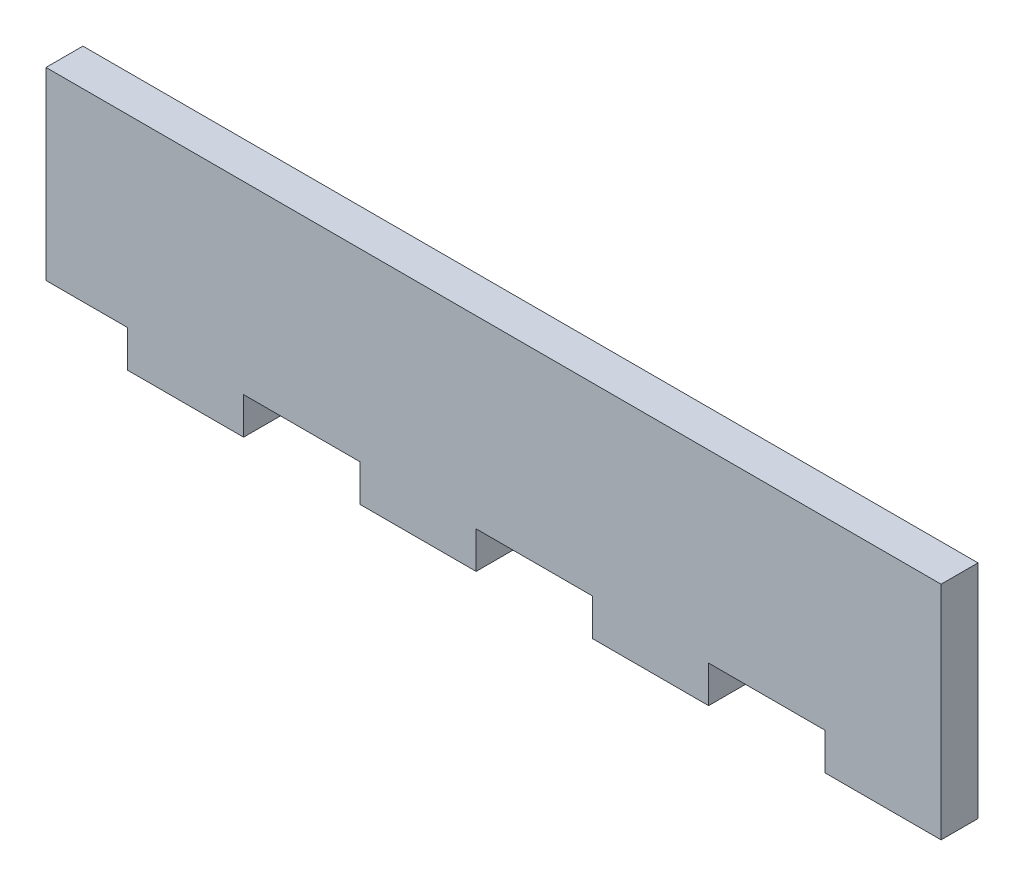
ISO-10303-21;
HEADER;
FILE_DESCRIPTION(('STEP AP214'),'2;1');
FILE_NAME('part.step','',(''),(''),'','','');
FILE_SCHEMA(('AUTOMOTIVE_DESIGN { 1 0 10303 214 1 1 1 1 }'));
ENDSEC;
DATA;
#1=APPLICATION_CONTEXT('core data for automotive mechanical design processes');
#2=APPLICATION_PROTOCOL_DEFINITION('international standard','automotive_design',2000,#1);
#3=PRODUCT_CONTEXT('',#1,'mechanical');
#4=PRODUCT('Part','Part','',(#3));
#5=PRODUCT_RELATED_PRODUCT_CATEGORY('part','',(#4));
#6=PRODUCT_DEFINITION_FORMATION('','',#4);
#7=PRODUCT_DEFINITION_CONTEXT('part definition',#1,'design');
#8=PRODUCT_DEFINITION('design','',#6,#7);
#9=PRODUCT_DEFINITION_SHAPE('','',#8);
#10=(LENGTH_UNIT() NAMED_UNIT(*) SI_UNIT(.MILLI.,.METRE.));
#11=(NAMED_UNIT(*) PLANE_ANGLE_UNIT() SI_UNIT($,.RADIAN.));
#12=(NAMED_UNIT(*) SI_UNIT($,.STERADIAN.) SOLID_ANGLE_UNIT());
#13=UNCERTAINTY_MEASURE_WITH_UNIT(LENGTH_MEASURE(1.E-05),#10,'distance_accuracy_value','');
#14=(GEOMETRIC_REPRESENTATION_CONTEXT(3) GLOBAL_UNCERTAINTY_ASSIGNED_CONTEXT((#13)) GLOBAL_UNIT_ASSIGNED_CONTEXT((#10,
#11,#12)) REPRESENTATION_CONTEXT('',''));
#15=CARTESIAN_POINT('',(0.,0.,0.));
#16=DIRECTION('',(0.,0.,1.));
#17=DIRECTION('',(1.,0.,0.));
#18=AXIS2_PLACEMENT_3D('',#15,#16,#17);
#19=CARTESIAN_POINT('',(77.,0.,2.15194444444444));
#20=DIRECTION('',(0.,1.,0.));
#21=DIRECTION('',(0.,0.,1.));
#22=AXIS2_PLACEMENT_3D('',#19,#20,#21);
#23=PLANE('',#22);
#24=DIRECTION('',(-1.,0.,0.));
#25=VECTOR('',#24,1.);
#26=CARTESIAN_POINT('',(77.,0.,-1.02305555555556));
#27=LINE('',#26,#25);
#28=CARTESIAN_POINT('',(7.00000000000001,0.,-1.02305555555556));
#29=VERTEX_POINT('',#28);
#30=CARTESIAN_POINT('',(0.,0.,-1.02305555555556));
#31=VERTEX_POINT('',#30);
#32=EDGE_CURVE('E208',#29,#31,#27,.T.);
#33=ORIENTED_EDGE('',*,*,#32,.F.);
#34=DIRECTION('',(0.,0.,-1.));
#35=VECTOR('',#34,1.);
#36=CARTESIAN_POINT('',(7.00000000000001,0.,2.15194444444444));
#37=LINE('',#36,#35);
#38=CARTESIAN_POINT('',(7.00000000000001,0.,2.15194444444444));
#39=VERTEX_POINT('',#38);
#40=EDGE_CURVE('E335',#39,#29,#37,.T.);
#41=ORIENTED_EDGE('',*,*,#40,.F.);
#42=DIRECTION('',(-1.,0.,0.));
#43=VECTOR('',#42,1.);
#44=CARTESIAN_POINT('',(77.,0.,2.15194444444444));
#45=LINE('',#44,#43);
#46=CARTESIAN_POINT('',(0.,0.,2.15194444444444));
#47=VERTEX_POINT('',#46);
#48=EDGE_CURVE('E49',#39,#47,#45,.T.);
#49=ORIENTED_EDGE('',*,*,#48,.T.);
#50=DIRECTION('',(0.,0.,-1.));
#51=VECTOR('',#50,1.);
#52=CARTESIAN_POINT('',(0.,0.,2.15194444444444));
#53=LINE('',#52,#51);
#54=EDGE_CURVE('E238',#47,#31,#53,.T.);
#55=ORIENTED_EDGE('',*,*,#54,.T.);
#56=EDGE_LOOP('',(#33,#41,#49,#55));
#57=FACE_BOUND('',#56,.T.);
#58=ADVANCED_FACE('F39',(#57),#23,.F.);
#59=CARTESIAN_POINT('',(27.,0.,2.15194444444444));
#60=VERTEX_POINT('',#59);
#61=CARTESIAN_POINT('',(17.,0.,2.15194444444444));
#62=VERTEX_POINT('',#61);
#63=EDGE_CURVE('E186',#60,#62,#45,.T.);
#64=ORIENTED_EDGE('',*,*,#63,.T.);
#65=DIRECTION('',(0.,0.,-1.));
#66=VECTOR('',#65,1.);
#67=CARTESIAN_POINT('',(17.,0.,2.15194444444444));
#68=LINE('',#67,#66);
#69=CARTESIAN_POINT('',(17.,0.,-1.02305555555556));
#70=VERTEX_POINT('',#69);
#71=EDGE_CURVE('E168',#62,#70,#68,.T.);
#72=ORIENTED_EDGE('',*,*,#71,.T.);
#73=CARTESIAN_POINT('',(27.,0.,-1.02305555555556));
#74=VERTEX_POINT('',#73);
#75=EDGE_CURVE('E213',#74,#70,#27,.T.);
#76=ORIENTED_EDGE('',*,*,#75,.F.);
#77=DIRECTION('',(0.,0.,-1.));
#78=VECTOR('',#77,1.);
#79=CARTESIAN_POINT('',(27.,0.,2.15194444444444));
#80=LINE('',#79,#78);
#81=EDGE_CURVE('E194',#60,#74,#80,.T.);
#82=ORIENTED_EDGE('',*,*,#81,.F.);
#83=EDGE_LOOP('',(#64,#72,#76,#82));
#84=FACE_BOUND('',#83,.T.);
#85=ADVANCED_FACE('F193',(#84),#23,.F.);
#86=CARTESIAN_POINT('',(47.,0.,2.15194444444444));
#87=VERTEX_POINT('',#86);
#88=CARTESIAN_POINT('',(37.,0.,2.15194444444444));
#89=VERTEX_POINT('',#88);
#90=EDGE_CURVE('E48',#87,#89,#45,.T.);
#91=ORIENTED_EDGE('',*,*,#90,.T.);
#92=DIRECTION('',(0.,0.,-1.));
#93=VECTOR('',#92,1.);
#94=CARTESIAN_POINT('',(37.,0.,2.15194444444444));
#95=LINE('',#94,#93);
#96=CARTESIAN_POINT('',(37.,0.,-1.02305555555556));
#97=VERTEX_POINT('',#96);
#98=EDGE_CURVE('E312',#89,#97,#95,.T.);
#99=ORIENTED_EDGE('',*,*,#98,.T.);
#100=CARTESIAN_POINT('',(47.,0.,-1.02305555555556));
#101=VERTEX_POINT('',#100);
#102=EDGE_CURVE('E207',#101,#97,#27,.T.);
#103=ORIENTED_EDGE('',*,*,#102,.F.);
#104=DIRECTION('',(0.,0.,-1.));
#105=VECTOR('',#104,1.);
#106=CARTESIAN_POINT('',(47.,0.,2.15194444444444));
#107=LINE('',#106,#105);
#108=EDGE_CURVE('E271',#87,#101,#107,.T.);
#109=ORIENTED_EDGE('',*,*,#108,.F.);
#110=EDGE_LOOP('',(#91,#99,#103,#109));
#111=FACE_BOUND('',#110,.T.);
#112=ADVANCED_FACE('F403',(#111),#23,.F.);
#113=CARTESIAN_POINT('',(67.,0.,2.15194444444444));
#114=VERTEX_POINT('',#113);
#115=CARTESIAN_POINT('',(57.,0.,2.15194444444444));
#116=VERTEX_POINT('',#115);
#117=EDGE_CURVE('E11',#114,#116,#45,.T.);
#118=ORIENTED_EDGE('',*,*,#117,.T.);
#119=DIRECTION('',(0.,0.,-1.));
#120=VECTOR('',#119,1.);
#121=CARTESIAN_POINT('',(57.,0.,2.15194444444444));
#122=LINE('',#121,#120);
#123=CARTESIAN_POINT('',(57.,0.,-1.02305555555556));
#124=VERTEX_POINT('',#123);
#125=EDGE_CURVE('E278',#116,#124,#122,.T.);
#126=ORIENTED_EDGE('',*,*,#125,.T.);
#127=CARTESIAN_POINT('',(67.,0.,-1.02305555555556));
#128=VERTEX_POINT('',#127);
#129=EDGE_CURVE('E199',#128,#124,#27,.T.);
#130=ORIENTED_EDGE('',*,*,#129,.F.);
#131=DIRECTION('',(0.,0.,-1.));
#132=VECTOR('',#131,1.);
#133=CARTESIAN_POINT('',(67.,0.,2.15194444444444));
#134=LINE('',#133,#132);
#135=EDGE_CURVE('E244',#114,#128,#134,.T.);
#136=ORIENTED_EDGE('',*,*,#135,.F.);
#137=EDGE_LOOP('',(#118,#126,#130,#136));
#138=FACE_BOUND('',#137,.T.);
#139=ADVANCED_FACE('F388',(#138),#23,.F.);
#140=CARTESIAN_POINT('',(77.,0.,2.15194444444444));
#141=DIRECTION('',(0.,0.,-1.));
#142=DIRECTION('',(-1.,0.,0.));
#143=AXIS2_PLACEMENT_3D('',#140,#141,#142);
#144=PLANE('',#143);
#145=DIRECTION('',(0.,-1.,0.));
#146=VECTOR('',#145,1.);
#147=CARTESIAN_POINT('',(0.,0.,2.15194444444444));
#148=LINE('',#147,#146);
#149=CARTESIAN_POINT('',(0.,15.875,2.15194444444444));
#150=VERTEX_POINT('',#149);
#151=EDGE_CURVE('E241',#150,#47,#148,.T.);
#152=ORIENTED_EDGE('',*,*,#151,.T.);
#153=ORIENTED_EDGE('',*,*,#48,.F.);
#154=DIRECTION('',(0.,1.,0.));
#155=VECTOR('',#154,1.);
#156=CARTESIAN_POINT('',(7.00000000000001,0.,2.15194444444444));
#157=LINE('',#156,#155);
#158=CARTESIAN_POINT('',(7.00000000000001,-3.175,2.15194444444444));
#159=VERTEX_POINT('',#158);
#160=EDGE_CURVE('E179',#159,#39,#157,.T.);
#161=ORIENTED_EDGE('',*,*,#160,.F.);
#162=DIRECTION('',(-1.,0.,0.));
#163=VECTOR('',#162,1.);
#164=CARTESIAN_POINT('',(17.,-3.175,2.15194444444444));
#165=LINE('',#164,#163);
#166=CARTESIAN_POINT('',(17.,-3.175,2.15194444444444));
#167=VERTEX_POINT('',#166);
#168=EDGE_CURVE('E189',#167,#159,#165,.T.);
#169=ORIENTED_EDGE('',*,*,#168,.F.);
#170=DIRECTION('',(0.,-1.,0.));
#171=VECTOR('',#170,1.);
#172=CARTESIAN_POINT('',(17.,0.,2.15194444444444));
#173=LINE('',#172,#171);
#174=EDGE_CURVE('E171',#62,#167,#173,.T.);
#175=ORIENTED_EDGE('',*,*,#174,.F.);
#176=ORIENTED_EDGE('',*,*,#63,.F.);
#177=DIRECTION('',(0.,1.,0.));
#178=VECTOR('',#177,1.);
#179=CARTESIAN_POINT('',(27.,0.,2.15194444444444));
#180=LINE('',#179,#178);
#181=CARTESIAN_POINT('',(27.,-3.175,2.15194444444444));
#182=VERTEX_POINT('',#181);
#183=EDGE_CURVE('E317',#182,#60,#180,.T.);
#184=ORIENTED_EDGE('',*,*,#183,.F.);
#185=DIRECTION('',(-1.,0.,0.));
#186=VECTOR('',#185,1.);
#187=CARTESIAN_POINT('',(37.,-3.175,2.15194444444444));
#188=LINE('',#187,#186);
#189=CARTESIAN_POINT('',(37.,-3.175,2.15194444444444));
#190=VERTEX_POINT('',#189);
#191=EDGE_CURVE('E338',#190,#182,#188,.T.);
#192=ORIENTED_EDGE('',*,*,#191,.F.);
#193=DIRECTION('',(0.,-1.,0.));
#194=VECTOR('',#193,1.);
#195=CARTESIAN_POINT('',(37.,0.,2.15194444444444));
#196=LINE('',#195,#194);
#197=EDGE_CURVE('E327',#89,#190,#196,.T.);
#198=ORIENTED_EDGE('',*,*,#197,.F.);
#199=ORIENTED_EDGE('',*,*,#90,.F.);
#200=DIRECTION('',(0.,1.,0.));
#201=VECTOR('',#200,1.);
#202=CARTESIAN_POINT('',(47.,0.,2.15194444444444));
#203=LINE('',#202,#201);
#204=CARTESIAN_POINT('',(47.,-3.175,2.15194444444444));
#205=VERTEX_POINT('',#204);
#206=EDGE_CURVE('E283',#205,#87,#203,.T.);
#207=ORIENTED_EDGE('',*,*,#206,.F.);
#208=DIRECTION('',(-1.,0.,0.));
#209=VECTOR('',#208,1.);
#210=CARTESIAN_POINT('',(57.,-3.175,2.15194444444444));
#211=LINE('',#210,#209);
#212=CARTESIAN_POINT('',(57.,-3.175,2.15194444444444));
#213=VERTEX_POINT('',#212);
#214=EDGE_CURVE('E305',#213,#205,#211,.T.);
#215=ORIENTED_EDGE('',*,*,#214,.F.);
#216=DIRECTION('',(0.,-1.,0.));
#217=VECTOR('',#216,1.);
#218=CARTESIAN_POINT('',(57.,0.,2.15194444444444));
#219=LINE('',#218,#217);
#220=EDGE_CURVE('E295',#116,#213,#219,.T.);
#221=ORIENTED_EDGE('',*,*,#220,.F.);
#222=ORIENTED_EDGE('',*,*,#117,.F.);
#223=DIRECTION('',(0.,1.,0.));
#224=VECTOR('',#223,1.);
#225=CARTESIAN_POINT('',(67.,0.,2.15194444444444));
#226=LINE('',#225,#224);
#227=CARTESIAN_POINT('',(67.,-3.175,2.15194444444444));
#228=VERTEX_POINT('',#227);
#229=EDGE_CURVE('E257',#228,#114,#226,.T.);
#230=ORIENTED_EDGE('',*,*,#229,.F.);
#231=DIRECTION('',(-1.,0.,0.));
#232=VECTOR('',#231,1.);
#233=CARTESIAN_POINT('',(77.,-3.175,2.15194444444444));
#234=LINE('',#233,#232);
#235=CARTESIAN_POINT('',(77.,-3.175,2.15194444444444));
#236=VERTEX_POINT('',#235);
#237=EDGE_CURVE('E266',#236,#228,#234,.T.);
#238=ORIENTED_EDGE('',*,*,#237,.F.);
#239=DIRECTION('',(0.,-1.,0.));
#240=VECTOR('',#239,1.);
#241=CARTESIAN_POINT('',(77.,0.,2.15194444444444));
#242=LINE('',#241,#240);
#243=CARTESIAN_POINT('',(77.,15.875,2.15194444444444));
#244=VERTEX_POINT('',#243);
#245=EDGE_CURVE('E234',#244,#236,#242,.T.);
#246=ORIENTED_EDGE('',*,*,#245,.F.);
#247=DIRECTION('',(-1.,0.,0.));
#248=VECTOR('',#247,1.);
#249=CARTESIAN_POINT('',(77.,15.875,2.15194444444444));
#250=LINE('',#249,#248);
#251=EDGE_CURVE('E221',#244,#150,#250,.T.);
#252=ORIENTED_EDGE('',*,*,#251,.T.);
#253=EDGE_LOOP('',(#152,#153,#161,#169,#175,#176,#184,#192,#198,#199,#207,#215,#221,#222,#230,
#238,#246,#252));
#254=FACE_BOUND('',#253,.T.);
#255=ADVANCED_FACE('F41',(#254),#144,.F.);
#256=CARTESIAN_POINT('',(77.,0.,-1.02305555555556));
#257=DIRECTION('',(0.,0.,1.));
#258=DIRECTION('',(0.,-1.,0.));
#259=AXIS2_PLACEMENT_3D('',#256,#257,#258);
#260=PLANE('',#259);
#261=DIRECTION('',(0.,1.,0.));
#262=VECTOR('',#261,1.);
#263=CARTESIAN_POINT('',(0.,0.,-1.02305555555556));
#264=LINE('',#263,#262);
#265=CARTESIAN_POINT('',(0.,15.875,-1.02305555555556));
#266=VERTEX_POINT('',#265);
#267=EDGE_CURVE('E235',#31,#266,#264,.T.);
#268=ORIENTED_EDGE('',*,*,#267,.T.);
#269=DIRECTION('',(-1.,0.,0.));
#270=VECTOR('',#269,1.);
#271=CARTESIAN_POINT('',(77.,15.875,-1.02305555555556));
#272=LINE('',#271,#270);
#273=CARTESIAN_POINT('',(77.,15.875,-1.02305555555556));
#274=VERTEX_POINT('',#273);
#275=EDGE_CURVE('E216',#274,#266,#272,.T.);
#276=ORIENTED_EDGE('',*,*,#275,.F.);
#277=DIRECTION('',(0.,1.,0.));
#278=VECTOR('',#277,1.);
#279=CARTESIAN_POINT('',(77.,0.,-1.02305555555556));
#280=LINE('',#279,#278);
#281=CARTESIAN_POINT('',(77.,-3.175,-1.02305555555556));
#282=VERTEX_POINT('',#281);
#283=EDGE_CURVE('E247',#282,#274,#280,.T.);
#284=ORIENTED_EDGE('',*,*,#283,.F.);
#285=DIRECTION('',(-1.,0.,0.));
#286=VECTOR('',#285,1.);
#287=CARTESIAN_POINT('',(77.,-3.175,-1.02305555555556));
#288=LINE('',#287,#286);
#289=CARTESIAN_POINT('',(67.,-3.175,-1.02305555555556));
#290=VERTEX_POINT('',#289);
#291=EDGE_CURVE('E267',#282,#290,#288,.T.);
#292=ORIENTED_EDGE('',*,*,#291,.T.);
#293=DIRECTION('',(0.,1.,0.));
#294=VECTOR('',#293,1.);
#295=CARTESIAN_POINT('',(67.,0.,-1.02305555555556));
#296=LINE('',#295,#294);
#297=EDGE_CURVE('E263',#290,#128,#296,.T.);
#298=ORIENTED_EDGE('',*,*,#297,.T.);
#299=ORIENTED_EDGE('',*,*,#129,.T.);
#300=DIRECTION('',(0.,-1.,0.));
#301=VECTOR('',#300,1.);
#302=CARTESIAN_POINT('',(57.,0.,-1.02305555555556));
#303=LINE('',#302,#301);
#304=CARTESIAN_POINT('',(57.,-3.175,-1.02305555555556));
#305=VERTEX_POINT('',#304);
#306=EDGE_CURVE('E300',#124,#305,#303,.T.);
#307=ORIENTED_EDGE('',*,*,#306,.T.);
#308=DIRECTION('',(-1.,0.,0.));
#309=VECTOR('',#308,1.);
#310=CARTESIAN_POINT('',(57.,-3.175,-1.02305555555556));
#311=LINE('',#310,#309);
#312=CARTESIAN_POINT('',(47.,-3.175,-1.02305555555556));
#313=VERTEX_POINT('',#312);
#314=EDGE_CURVE('E296',#305,#313,#311,.T.);
#315=ORIENTED_EDGE('',*,*,#314,.T.);
#316=DIRECTION('',(0.,1.,0.));
#317=VECTOR('',#316,1.);
#318=CARTESIAN_POINT('',(47.,0.,-1.02305555555556));
#319=LINE('',#318,#317);
#320=EDGE_CURVE('E292',#313,#101,#319,.T.);
#321=ORIENTED_EDGE('',*,*,#320,.T.);
#322=ORIENTED_EDGE('',*,*,#102,.T.);
#323=DIRECTION('',(0.,-1.,0.));
#324=VECTOR('',#323,1.);
#325=CARTESIAN_POINT('',(37.,0.,-1.02305555555556));
#326=LINE('',#325,#324);
#327=CARTESIAN_POINT('',(37.,-3.175,-1.02305555555556));
#328=VERTEX_POINT('',#327);
#329=EDGE_CURVE('E331',#97,#328,#326,.T.);
#330=ORIENTED_EDGE('',*,*,#329,.T.);
#331=DIRECTION('',(-1.,0.,0.));
#332=VECTOR('',#331,1.);
#333=CARTESIAN_POINT('',(37.,-3.175,-1.02305555555556));
#334=LINE('',#333,#332);
#335=CARTESIAN_POINT('',(27.,-3.175,-1.02305555555556));
#336=VERTEX_POINT('',#335);
#337=EDGE_CURVE('E328',#328,#336,#334,.T.);
#338=ORIENTED_EDGE('',*,*,#337,.T.);
#339=DIRECTION('',(0.,1.,0.));
#340=VECTOR('',#339,1.);
#341=CARTESIAN_POINT('',(27.,0.,-1.02305555555556));
#342=LINE('',#341,#340);
#343=EDGE_CURVE('E63',#336,#74,#342,.T.);
#344=ORIENTED_EDGE('',*,*,#343,.T.);
#345=ORIENTED_EDGE('',*,*,#75,.T.);
#346=DIRECTION('',(0.,-1.,0.));
#347=VECTOR('',#346,1.);
#348=CARTESIAN_POINT('',(17.,0.,-1.02305555555556));
#349=LINE('',#348,#347);
#350=CARTESIAN_POINT('',(17.,-3.175,-1.02305555555556));
#351=VERTEX_POINT('',#350);
#352=EDGE_CURVE('E173',#70,#351,#349,.T.);
#353=ORIENTED_EDGE('',*,*,#352,.T.);
#354=DIRECTION('',(-1.,0.,0.));
#355=VECTOR('',#354,1.);
#356=CARTESIAN_POINT('',(17.,-3.175,-1.02305555555556));
#357=LINE('',#356,#355);
#358=CARTESIAN_POINT('',(7.00000000000001,-3.175,-1.02305555555556));
#359=VERTEX_POINT('',#358);
#360=EDGE_CURVE('E354',#351,#359,#357,.T.);
#361=ORIENTED_EDGE('',*,*,#360,.T.);
#362=DIRECTION('',(0.,1.,0.));
#363=VECTOR('',#362,1.);
#364=CARTESIAN_POINT('',(7.00000000000001,0.,-1.02305555555556));
#365=LINE('',#364,#363);
#366=EDGE_CURVE('E56',#359,#29,#365,.T.);
#367=ORIENTED_EDGE('',*,*,#366,.T.);
#368=ORIENTED_EDGE('',*,*,#32,.T.);
#369=EDGE_LOOP('',(#268,#276,#284,#292,#298,#299,#307,#315,#321,#322,#330,#338,#344,#345,#353,
#361,#367,#368));
#370=FACE_BOUND('',#369,.T.);
#371=ADVANCED_FACE('F371',(#370),#260,.F.);
#372=CARTESIAN_POINT('',(77.,15.875,2.15194444444444));
#373=DIRECTION('',(0.,-1.,0.));
#374=DIRECTION('',(0.,0.,-1.));
#375=AXIS2_PLACEMENT_3D('',#372,#373,#374);
#376=PLANE('',#375);
#377=DIRECTION('',(0.,0.,1.));
#378=VECTOR('',#377,1.);
#379=CARTESIAN_POINT('',(0.,15.875,2.15194444444444));
#380=LINE('',#379,#378);
#381=EDGE_CURVE('E231',#266,#150,#380,.T.);
#382=ORIENTED_EDGE('',*,*,#381,.T.);
#383=ORIENTED_EDGE('',*,*,#251,.F.);
#384=DIRECTION('',(0.,0.,1.));
#385=VECTOR('',#384,1.);
#386=CARTESIAN_POINT('',(77.,15.875,2.15194444444444));
#387=LINE('',#386,#385);
#388=EDGE_CURVE('E228',#274,#244,#387,.T.);
#389=ORIENTED_EDGE('',*,*,#388,.F.);
#390=ORIENTED_EDGE('',*,*,#275,.T.);
#391=EDGE_LOOP('',(#382,#383,#389,#390));
#392=FACE_BOUND('',#391,.T.);
#393=ADVANCED_FACE('F373',(#392),#376,.F.);
#394=CARTESIAN_POINT('',(77.,0.,0.));
#395=DIRECTION('',(-1.,0.,0.));
#396=DIRECTION('',(0.,0.,1.));
#397=AXIS2_PLACEMENT_3D('',#394,#395,#396);
#398=PLANE('',#397);
#399=ORIENTED_EDGE('',*,*,#245,.T.);
#400=DIRECTION('',(0.,0.,-1.));
#401=VECTOR('',#400,1.);
#402=CARTESIAN_POINT('',(77.,-3.175,2.15194444444444));
#403=LINE('',#402,#401);
#404=EDGE_CURVE('E252',#236,#282,#403,.T.);
#405=ORIENTED_EDGE('',*,*,#404,.T.);
#406=ORIENTED_EDGE('',*,*,#283,.T.);
#407=ORIENTED_EDGE('',*,*,#388,.T.);
#408=EDGE_LOOP('',(#399,#405,#406,#407));
#409=FACE_BOUND('',#408,.T.);
#410=ADVANCED_FACE('F376',(#409),#398,.F.);
#411=CARTESIAN_POINT('',(0.,0.,0.));
#412=DIRECTION('',(-1.,0.,0.));
#413=DIRECTION('',(0.,0.,1.));
#414=AXIS2_PLACEMENT_3D('',#411,#412,#413);
#415=PLANE('',#414);
#416=ORIENTED_EDGE('',*,*,#151,.F.);
#417=ORIENTED_EDGE('',*,*,#381,.F.);
#418=ORIENTED_EDGE('',*,*,#267,.F.);
#419=ORIENTED_EDGE('',*,*,#54,.F.);
#420=EDGE_LOOP('',(#416,#417,#418,#419));
#421=FACE_BOUND('',#420,.T.);
#422=ADVANCED_FACE('F370',(#421),#415,.T.);
#423=CARTESIAN_POINT('',(67.,0.,2.15194444444444));
#424=DIRECTION('',(-1.,0.,0.));
#425=DIRECTION('',(0.,0.,1.));
#426=AXIS2_PLACEMENT_3D('',#423,#424,#425);
#427=PLANE('',#426);
#428=ORIENTED_EDGE('',*,*,#297,.F.);
#429=DIRECTION('',(0.,0.,-1.));
#430=VECTOR('',#429,1.);
#431=CARTESIAN_POINT('',(67.,-3.175,2.15194444444444));
#432=LINE('',#431,#430);
#433=EDGE_CURVE('E256',#228,#290,#432,.T.);
#434=ORIENTED_EDGE('',*,*,#433,.F.);
#435=ORIENTED_EDGE('',*,*,#229,.T.);
#436=ORIENTED_EDGE('',*,*,#135,.T.);
#437=EDGE_LOOP('',(#428,#434,#435,#436));
#438=FACE_BOUND('',#437,.T.);
#439=ADVANCED_FACE('F384',(#438),#427,.T.);
#440=CARTESIAN_POINT('',(77.,-3.175,2.15194444444444));
#441=DIRECTION('',(0.,-1.,0.));
#442=DIRECTION('',(0.,0.,-1.));
#443=AXIS2_PLACEMENT_3D('',#440,#441,#442);
#444=PLANE('',#443);
#445=ORIENTED_EDGE('',*,*,#291,.F.);
#446=ORIENTED_EDGE('',*,*,#404,.F.);
#447=ORIENTED_EDGE('',*,*,#237,.T.);
#448=ORIENTED_EDGE('',*,*,#433,.T.);
#449=EDGE_LOOP('',(#445,#446,#447,#448));
#450=FACE_BOUND('',#449,.T.);
#451=ADVANCED_FACE('F381',(#450),#444,.T.);
#452=CARTESIAN_POINT('',(47.,0.,2.15194444444444));
#453=DIRECTION('',(-1.,0.,0.));
#454=DIRECTION('',(0.,0.,1.));
#455=AXIS2_PLACEMENT_3D('',#452,#453,#454);
#456=PLANE('',#455);
#457=ORIENTED_EDGE('',*,*,#320,.F.);
#458=DIRECTION('',(0.,0.,-1.));
#459=VECTOR('',#458,1.);
#460=CARTESIAN_POINT('',(47.,-3.175,2.15194444444444));
#461=LINE('',#460,#459);
#462=EDGE_CURVE('E286',#205,#313,#461,.T.);
#463=ORIENTED_EDGE('',*,*,#462,.F.);
#464=ORIENTED_EDGE('',*,*,#206,.T.);
#465=ORIENTED_EDGE('',*,*,#108,.T.);
#466=EDGE_LOOP('',(#457,#463,#464,#465));
#467=FACE_BOUND('',#466,.T.);
#468=ADVANCED_FACE('F398',(#467),#456,.T.);
#469=CARTESIAN_POINT('',(57.,-3.175,2.15194444444444));
#470=DIRECTION('',(0.,-1.,0.));
#471=DIRECTION('',(0.,0.,-1.));
#472=AXIS2_PLACEMENT_3D('',#469,#470,#471);
#473=PLANE('',#472);
#474=ORIENTED_EDGE('',*,*,#314,.F.);
#475=DIRECTION('',(0.,0.,-1.));
#476=VECTOR('',#475,1.);
#477=CARTESIAN_POINT('',(57.,-3.175,2.15194444444444));
#478=LINE('',#477,#476);
#479=EDGE_CURVE('E282',#213,#305,#478,.T.);
#480=ORIENTED_EDGE('',*,*,#479,.F.);
#481=ORIENTED_EDGE('',*,*,#214,.T.);
#482=ORIENTED_EDGE('',*,*,#462,.T.);
#483=EDGE_LOOP('',(#474,#480,#481,#482));
#484=FACE_BOUND('',#483,.T.);
#485=ADVANCED_FACE('F420',(#484),#473,.T.);
#486=CARTESIAN_POINT('',(57.,0.,2.15194444444444));
#487=DIRECTION('',(1.,0.,0.));
#488=DIRECTION('',(0.,0.,-1.));
#489=AXIS2_PLACEMENT_3D('',#486,#487,#488);
#490=PLANE('',#489);
#491=ORIENTED_EDGE('',*,*,#306,.F.);
#492=ORIENTED_EDGE('',*,*,#125,.F.);
#493=ORIENTED_EDGE('',*,*,#220,.T.);
#494=ORIENTED_EDGE('',*,*,#479,.T.);
#495=EDGE_LOOP('',(#491,#492,#493,#494));
#496=FACE_BOUND('',#495,.T.);
#497=ADVANCED_FACE('F393',(#496),#490,.T.);
#498=CARTESIAN_POINT('',(27.,0.,2.15194444444444));
#499=DIRECTION('',(-1.,0.,0.));
#500=DIRECTION('',(0.,0.,1.));
#501=AXIS2_PLACEMENT_3D('',#498,#499,#500);
#502=PLANE('',#501);
#503=ORIENTED_EDGE('',*,*,#343,.F.);
#504=DIRECTION('',(0.,0.,-1.));
#505=VECTOR('',#504,1.);
#506=CARTESIAN_POINT('',(27.,-3.175,2.15194444444444));
#507=LINE('',#506,#505);
#508=EDGE_CURVE('E320',#182,#336,#507,.T.);
#509=ORIENTED_EDGE('',*,*,#508,.F.);
#510=ORIENTED_EDGE('',*,*,#183,.T.);
#511=ORIENTED_EDGE('',*,*,#81,.T.);
#512=EDGE_LOOP('',(#503,#509,#510,#511));
#513=FACE_BOUND('',#512,.T.);
#514=ADVANCED_FACE('F412',(#513),#502,.T.);
#515=CARTESIAN_POINT('',(37.,-3.175,2.15194444444444));
#516=DIRECTION('',(0.,-1.,0.));
#517=DIRECTION('',(0.,0.,-1.));
#518=AXIS2_PLACEMENT_3D('',#515,#516,#517);
#519=PLANE('',#518);
#520=ORIENTED_EDGE('',*,*,#337,.F.);
#521=DIRECTION('',(0.,0.,-1.));
#522=VECTOR('',#521,1.);
#523=CARTESIAN_POINT('',(37.,-3.175,2.15194444444444));
#524=LINE('',#523,#522);
#525=EDGE_CURVE('E316',#190,#328,#524,.T.);
#526=ORIENTED_EDGE('',*,*,#525,.F.);
#527=ORIENTED_EDGE('',*,*,#191,.T.);
#528=ORIENTED_EDGE('',*,*,#508,.T.);
#529=EDGE_LOOP('',(#520,#526,#527,#528));
#530=FACE_BOUND('',#529,.T.);
#531=ADVANCED_FACE('F410',(#530),#519,.T.);
#532=CARTESIAN_POINT('',(37.,0.,2.15194444444444));
#533=DIRECTION('',(1.,0.,0.));
#534=DIRECTION('',(0.,0.,-1.));
#535=AXIS2_PLACEMENT_3D('',#532,#533,#534);
#536=PLANE('',#535);
#537=ORIENTED_EDGE('',*,*,#329,.F.);
#538=ORIENTED_EDGE('',*,*,#98,.F.);
#539=ORIENTED_EDGE('',*,*,#197,.T.);
#540=ORIENTED_EDGE('',*,*,#525,.T.);
#541=EDGE_LOOP('',(#537,#538,#539,#540));
#542=FACE_BOUND('',#541,.T.);
#543=ADVANCED_FACE('F406',(#542),#536,.T.);
#544=CARTESIAN_POINT('',(7.00000000000001,0.,2.15194444444444));
#545=DIRECTION('',(-1.,0.,0.));
#546=DIRECTION('',(0.,0.,1.));
#547=AXIS2_PLACEMENT_3D('',#544,#545,#546);
#548=PLANE('',#547);
#549=ORIENTED_EDGE('',*,*,#366,.F.);
#550=DIRECTION('',(0.,0.,-1.));
#551=VECTOR('',#550,1.);
#552=CARTESIAN_POINT('',(7.00000000000001,-3.175,2.15194444444444));
#553=LINE('',#552,#551);
#554=EDGE_CURVE('E347',#159,#359,#553,.T.);
#555=ORIENTED_EDGE('',*,*,#554,.F.);
#556=ORIENTED_EDGE('',*,*,#160,.T.);
#557=ORIENTED_EDGE('',*,*,#40,.T.);
#558=EDGE_LOOP('',(#549,#555,#556,#557));
#559=FACE_BOUND('',#558,.T.);
#560=ADVANCED_FACE('F366',(#559),#548,.T.);
#561=CARTESIAN_POINT('',(17.,-3.175,2.15194444444444));
#562=DIRECTION('',(0.,-1.,0.));
#563=DIRECTION('',(0.,0.,-1.));
#564=AXIS2_PLACEMENT_3D('',#561,#562,#563);
#565=PLANE('',#564);
#566=ORIENTED_EDGE('',*,*,#360,.F.);
#567=DIRECTION('',(0.,0.,-1.));
#568=VECTOR('',#567,1.);
#569=CARTESIAN_POINT('',(17.,-3.175,2.15194444444444));
#570=LINE('',#569,#568);
#571=EDGE_CURVE('E178',#167,#351,#570,.T.);
#572=ORIENTED_EDGE('',*,*,#571,.F.);
#573=ORIENTED_EDGE('',*,*,#168,.T.);
#574=ORIENTED_EDGE('',*,*,#554,.T.);
#575=EDGE_LOOP('',(#566,#572,#573,#574));
#576=FACE_BOUND('',#575,.T.);
#577=ADVANCED_FACE('F364',(#576),#565,.T.);
#578=CARTESIAN_POINT('',(17.,0.,2.15194444444444));
#579=DIRECTION('',(1.,0.,0.));
#580=DIRECTION('',(0.,0.,-1.));
#581=AXIS2_PLACEMENT_3D('',#578,#579,#580);
#582=PLANE('',#581);
#583=ORIENTED_EDGE('',*,*,#352,.F.);
#584=ORIENTED_EDGE('',*,*,#71,.F.);
#585=ORIENTED_EDGE('',*,*,#174,.T.);
#586=ORIENTED_EDGE('',*,*,#571,.T.);
#587=EDGE_LOOP('',(#583,#584,#585,#586));
#588=FACE_BOUND('',#587,.T.);
#589=ADVANCED_FACE('F170',(#588),#582,.T.);
#590=CLOSED_SHELL('',(#58,#85,#112,#139,#255,#371,#393,#410,#422,#439,#451,#468,#485,#497,#514,
#531,#543,#560,#577,#589));
#591=MANIFOLD_SOLID_BREP('B2',#590);
#592=ADVANCED_BREP_SHAPE_REPRESENTATION('',(#18,#591),#14);
#593=SHAPE_DEFINITION_REPRESENTATION(#9,#592);
ENDSEC;
END-ISO-10303-21;
